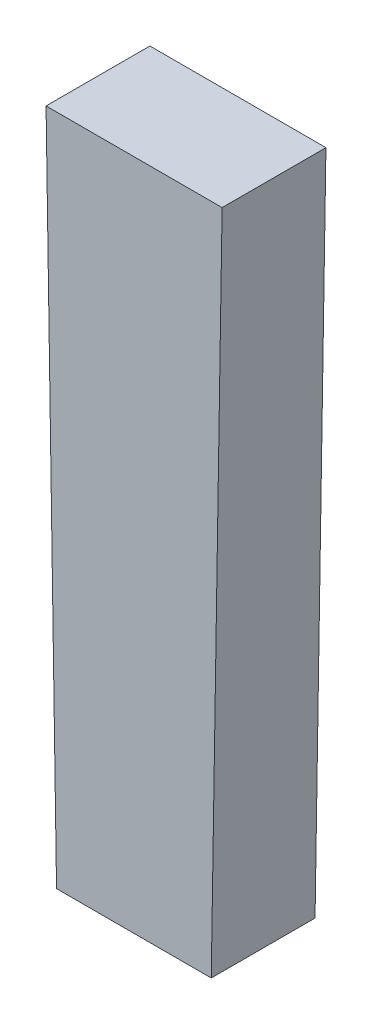
ISO-10303-21;
HEADER;
FILE_DESCRIPTION(('STEP AP214'),'2;1');
FILE_NAME('part.step','',(''),(''),'','','');
FILE_SCHEMA(('AUTOMOTIVE_DESIGN { 1 0 10303 214 1 1 1 1 }'));
ENDSEC;
DATA;
#1=APPLICATION_CONTEXT('core data for automotive mechanical design processes');
#2=APPLICATION_PROTOCOL_DEFINITION('international standard','automotive_design',2000,#1);
#3=PRODUCT_CONTEXT('',#1,'mechanical');
#4=PRODUCT('Part','Part','',(#3));
#5=PRODUCT_RELATED_PRODUCT_CATEGORY('part','',(#4));
#6=PRODUCT_DEFINITION_FORMATION('','',#4);
#7=PRODUCT_DEFINITION_CONTEXT('part definition',#1,'design');
#8=PRODUCT_DEFINITION('design','',#6,#7);
#9=PRODUCT_DEFINITION_SHAPE('','',#8);
#10=(LENGTH_UNIT() NAMED_UNIT(*) SI_UNIT(.MILLI.,.METRE.));
#11=(NAMED_UNIT(*) PLANE_ANGLE_UNIT() SI_UNIT($,.RADIAN.));
#12=(NAMED_UNIT(*) SI_UNIT($,.STERADIAN.) SOLID_ANGLE_UNIT());
#13=UNCERTAINTY_MEASURE_WITH_UNIT(LENGTH_MEASURE(1.E-05),#10,'distance_accuracy_value','');
#14=(GEOMETRIC_REPRESENTATION_CONTEXT(3) GLOBAL_UNCERTAINTY_ASSIGNED_CONTEXT((#13)) GLOBAL_UNIT_ASSIGNED_CONTEXT((#10,
#11,#12)) REPRESENTATION_CONTEXT('',''));
#15=CARTESIAN_POINT('',(0.,0.,0.));
#16=DIRECTION('',(0.,0.,1.));
#17=DIRECTION('',(1.,0.,0.));
#18=AXIS2_PLACEMENT_3D('',#15,#16,#17);
#19=CARTESIAN_POINT('',(170.627671483861,130.711802741894,-38.9997200126349));
#20=DIRECTION('',(0.,0.,-1.));
#21=DIRECTION('',(-1.,0.,0.));
#22=AXIS2_PLACEMENT_3D('',#19,#20,#21);
#23=PLANE('',#22);
#24=DIRECTION('',(0.0161687913569441,0.999869276548717,0.));
#25=VECTOR('',#24,1.);
#26=CARTESIAN_POINT('',(170.702182632352,130.711802741894,-38.9997200126349));
#27=LINE('',#26,#25);
#28=CARTESIAN_POINT('',(170.712660762609,131.359764626489,-38.9997200126349));
#29=VERTEX_POINT('',#28);
#30=CARTESIAN_POINT('',(170.702182632352,130.711802741894,-38.9997200126349));
#31=VERTEX_POINT('',#30);
#32=EDGE_CURVE('E79',#29,#31,#27,.F.);
#33=ORIENTED_EDGE('',*,*,#32,.F.);
#34=DIRECTION('',(1.,0.,0.));
#35=VECTOR('',#34,1.);
#36=CARTESIAN_POINT('',(170.712660762609,131.359764626489,-38.9997200126349));
#37=LINE('',#36,#35);
#38=CARTESIAN_POINT('',(170.543070284011,131.359764626489,-38.9997200126349));
#39=VERTEX_POINT('',#38);
#40=EDGE_CURVE('E55',#39,#29,#37,.T.);
#41=ORIENTED_EDGE('',*,*,#40,.F.);
#42=DIRECTION('',(0.0155700952002916,-0.999878778720428,0.));
#43=VECTOR('',#42,1.);
#44=CARTESIAN_POINT('',(170.543070284011,131.359764626489,-38.9997200126349));
#45=LINE('',#44,#43);
#46=CARTESIAN_POINT('',(170.553160335369,130.711802741894,-38.9997200126349));
#47=VERTEX_POINT('',#46);
#48=EDGE_CURVE('E57',#47,#39,#45,.F.);
#49=ORIENTED_EDGE('',*,*,#48,.F.);
#50=DIRECTION('',(1.,0.,0.));
#51=VECTOR('',#50,1.);
#52=CARTESIAN_POINT('',(170.553160335369,130.711802741894,-38.9997200126349));
#53=LINE('',#52,#51);
#54=EDGE_CURVE('E20',#31,#47,#53,.F.);
#55=ORIENTED_EDGE('',*,*,#54,.F.);
#56=EDGE_LOOP('',(#33,#41,#49,#55));
#57=FACE_BOUND('',#56,.T.);
#58=ADVANCED_FACE('F17',(#57),#23,.F.);
#59=CARTESIAN_POINT('',(170.553160335369,130.711802741894,-39.0997200126349));
#60=DIRECTION('',(0.,-1.,0.));
#61=DIRECTION('',(0.,0.,-1.));
#62=AXIS2_PLACEMENT_3D('',#59,#60,#61);
#63=PLANE('',#62);
#64=DIRECTION('',(-1.,0.,0.));
#65=VECTOR('',#64,1.);
#66=CARTESIAN_POINT('',(170.627671483861,130.711802741894,-39.0997200126349));
#67=LINE('',#66,#65);
#68=CARTESIAN_POINT('',(170.702182632352,130.711802741894,-39.0997200126349));
#69=VERTEX_POINT('',#68);
#70=CARTESIAN_POINT('',(170.553160335369,130.711802741894,-39.0997200126349));
#71=VERTEX_POINT('',#70);
#72=EDGE_CURVE('E83',#69,#71,#67,.T.);
#73=ORIENTED_EDGE('',*,*,#72,.F.);
#74=DIRECTION('',(0.,0.,1.));
#75=VECTOR('',#74,1.);
#76=CARTESIAN_POINT('',(170.702182632352,130.711802741894,-39.0997200126349));
#77=LINE('',#76,#75);
#78=EDGE_CURVE('E68',#31,#69,#77,.F.);
#79=ORIENTED_EDGE('',*,*,#78,.F.);
#80=ORIENTED_EDGE('',*,*,#54,.T.);
#81=DIRECTION('',(0.,0.,1.));
#82=VECTOR('',#81,1.);
#83=CARTESIAN_POINT('',(170.553160335369,130.711802741894,-39.0997200126349));
#84=LINE('',#83,#82);
#85=EDGE_CURVE('E63',#71,#47,#84,.T.);
#86=ORIENTED_EDGE('',*,*,#85,.F.);
#87=EDGE_LOOP('',(#73,#79,#80,#86));
#88=FACE_BOUND('',#87,.T.);
#89=ADVANCED_FACE('F65',(#88),#63,.T.);
#90=CARTESIAN_POINT('',(170.543070284011,131.359764626489,-39.0997200126349));
#91=DIRECTION('',(-0.999878778720428,-0.0155700952002916,0.));
#92=DIRECTION('',(0.0155700952002916,-0.999878778720428,0.));
#93=AXIS2_PLACEMENT_3D('',#90,#91,#92);
#94=PLANE('',#93);
#95=DIRECTION('',(-0.0155700952002061,0.999878778720429,0.));
#96=VECTOR('',#95,1.);
#97=CARTESIAN_POINT('',(170.553160335369,130.711802741894,-39.0997200126349));
#98=LINE('',#97,#96);
#99=CARTESIAN_POINT('',(170.543070284011,131.359764626489,-39.0997200126349));
#100=VERTEX_POINT('',#99);
#101=EDGE_CURVE('E72',#71,#100,#98,.T.);
#102=ORIENTED_EDGE('',*,*,#101,.F.);
#103=ORIENTED_EDGE('',*,*,#85,.T.);
#104=ORIENTED_EDGE('',*,*,#48,.T.);
#105=DIRECTION('',(0.,0.,1.));
#106=VECTOR('',#105,1.);
#107=CARTESIAN_POINT('',(170.543070284011,131.359764626489,-39.0997200126349));
#108=LINE('',#107,#106);
#109=EDGE_CURVE('E75',#100,#39,#108,.T.);
#110=ORIENTED_EDGE('',*,*,#109,.F.);
#111=EDGE_LOOP('',(#102,#103,#104,#110));
#112=FACE_BOUND('',#111,.T.);
#113=ADVANCED_FACE('F70',(#112),#94,.T.);
#114=CARTESIAN_POINT('',(170.712660762609,131.359764626489,-39.0997200126349));
#115=DIRECTION('',(0.,1.,0.));
#116=DIRECTION('',(0.,0.,1.));
#117=AXIS2_PLACEMENT_3D('',#114,#115,#116);
#118=PLANE('',#117);
#119=DIRECTION('',(-1.,0.,0.));
#120=VECTOR('',#119,1.);
#121=CARTESIAN_POINT('',(170.627671483861,131.359764626489,-39.0997200126349));
#122=LINE('',#121,#120);
#123=CARTESIAN_POINT('',(170.712660762609,131.359764626489,-39.0997200126349));
#124=VERTEX_POINT('',#123);
#125=EDGE_CURVE('E26',#100,#124,#122,.F.);
#126=ORIENTED_EDGE('',*,*,#125,.F.);
#127=ORIENTED_EDGE('',*,*,#109,.T.);
#128=ORIENTED_EDGE('',*,*,#40,.T.);
#129=DIRECTION('',(0.,0.,1.));
#130=VECTOR('',#129,1.);
#131=CARTESIAN_POINT('',(170.712660762609,131.359764626489,-39.0997200126349));
#132=LINE('',#131,#130);
#133=EDGE_CURVE('E35',#124,#29,#132,.T.);
#134=ORIENTED_EDGE('',*,*,#133,.F.);
#135=EDGE_LOOP('',(#126,#127,#128,#134));
#136=FACE_BOUND('',#135,.T.);
#137=ADVANCED_FACE('F89',(#136),#118,.T.);
#138=CARTESIAN_POINT('',(170.702182632352,130.711802741894,-39.0997200126349));
#139=DIRECTION('',(0.999869276548717,-0.0161687913569441,0.));
#140=DIRECTION('',(0.0161687913569441,0.999869276548717,0.));
#141=AXIS2_PLACEMENT_3D('',#138,#139,#140);
#142=PLANE('',#141);
#143=DIRECTION('',(-0.0161687913570727,-0.999869276548715,0.));
#144=VECTOR('',#143,1.);
#145=CARTESIAN_POINT('',(170.712660762609,131.359764626489,-39.0997200126349));
#146=LINE('',#145,#144);
#147=EDGE_CURVE('E11',#124,#69,#146,.T.);
#148=ORIENTED_EDGE('',*,*,#147,.F.);
#149=ORIENTED_EDGE('',*,*,#133,.T.);
#150=ORIENTED_EDGE('',*,*,#32,.T.);
#151=ORIENTED_EDGE('',*,*,#78,.T.);
#152=EDGE_LOOP('',(#148,#149,#150,#151));
#153=FACE_BOUND('',#152,.T.);
#154=ADVANCED_FACE('F91',(#153),#142,.T.);
#155=CARTESIAN_POINT('',(170.627671483861,130.711802741894,-39.0997200126349));
#156=DIRECTION('',(0.,0.,-1.));
#157=DIRECTION('',(-1.,0.,0.));
#158=AXIS2_PLACEMENT_3D('',#155,#156,#157);
#159=PLANE('',#158);
#160=ORIENTED_EDGE('',*,*,#125,.T.);
#161=ORIENTED_EDGE('',*,*,#147,.T.);
#162=ORIENTED_EDGE('',*,*,#72,.T.);
#163=ORIENTED_EDGE('',*,*,#101,.T.);
#164=EDGE_LOOP('',(#160,#161,#162,#163));
#165=FACE_BOUND('',#164,.T.);
#166=ADVANCED_FACE('F88',(#165),#159,.T.);
#167=CLOSED_SHELL('',(#58,#89,#113,#137,#154,#166));
#168=MANIFOLD_SOLID_BREP('B1',#167);
#169=ADVANCED_BREP_SHAPE_REPRESENTATION('',(#18,#168),#14);
#170=SHAPE_DEFINITION_REPRESENTATION(#9,#169);
ENDSEC;
END-ISO-10303-21;
